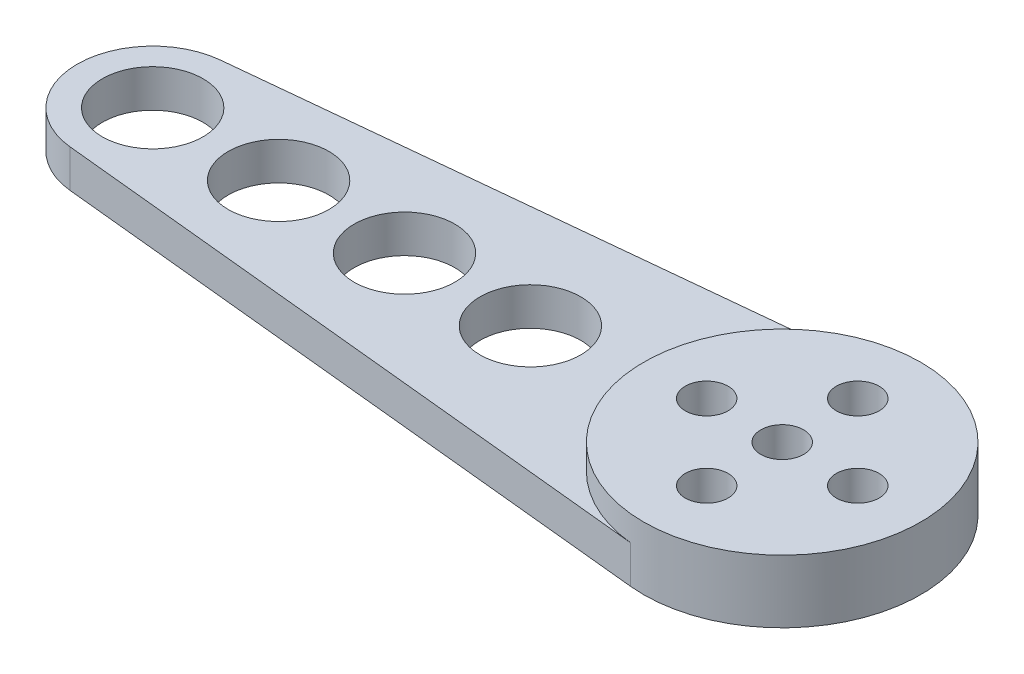
ISO-10303-21;
HEADER;
FILE_DESCRIPTION(('STEP AP214'),'2;1');
FILE_NAME('part.step','',(''),(''),'','','');
FILE_SCHEMA(('AUTOMOTIVE_DESIGN { 1 0 10303 214 1 1 1 1 }'));
ENDSEC;
DATA;
#1=APPLICATION_CONTEXT('core data for automotive mechanical design processes');
#2=APPLICATION_PROTOCOL_DEFINITION('international standard','automotive_design',2000,#1);
#3=PRODUCT_CONTEXT('',#1,'mechanical');
#4=PRODUCT('Part','Part','',(#3));
#5=PRODUCT_RELATED_PRODUCT_CATEGORY('part','',(#4));
#6=PRODUCT_DEFINITION_FORMATION('','',#4);
#7=PRODUCT_DEFINITION_CONTEXT('part definition',#1,'design');
#8=PRODUCT_DEFINITION('design','',#6,#7);
#9=PRODUCT_DEFINITION_SHAPE('','',#8);
#10=(LENGTH_UNIT() NAMED_UNIT(*) SI_UNIT(.MILLI.,.METRE.));
#11=(NAMED_UNIT(*) PLANE_ANGLE_UNIT() SI_UNIT($,.RADIAN.));
#12=(NAMED_UNIT(*) SI_UNIT($,.STERADIAN.) SOLID_ANGLE_UNIT());
#13=UNCERTAINTY_MEASURE_WITH_UNIT(LENGTH_MEASURE(1.E-05),#10,'distance_accuracy_value','');
#14=(GEOMETRIC_REPRESENTATION_CONTEXT(3) GLOBAL_UNCERTAINTY_ASSIGNED_CONTEXT((#13)) GLOBAL_UNIT_ASSIGNED_CONTEXT((#10,
#11,#12)) REPRESENTATION_CONTEXT('',''));
#15=CARTESIAN_POINT('',(0.,0.,0.));
#16=DIRECTION('',(0.,0.,1.));
#17=DIRECTION('',(1.,0.,0.));
#18=AXIS2_PLACEMENT_3D('',#15,#16,#17);
#19=CARTESIAN_POINT('',(-50.,3.,0.));
#20=DIRECTION('',(0.,1.,0.));
#21=DIRECTION('',(0.,0.,1.));
#22=AXIS2_PLACEMENT_3D('',#19,#20,#21);
#23=PLANE('',#22);
#24=CARTESIAN_POINT('',(0.,3.,0.));
#25=DIRECTION('',(0.,1.,0.));
#26=DIRECTION('',(0.,0.,1.));
#27=AXIS2_PLACEMENT_3D('',#24,#25,#26);
#28=CIRCLE('',#27,11.);
#29=CARTESIAN_POINT('',(-1.1,3.,-10.9448618081728));
#30=VERTEX_POINT('',#29);
#31=CARTESIAN_POINT('',(-1.1,3.,10.9448618081728));
#32=VERTEX_POINT('',#31);
#33=EDGE_CURVE('E174',#30,#32,#28,.T.);
#34=ORIENTED_EDGE('',*,*,#33,.F.);
#35=DIRECTION('',(-0.99498743710662,0.,0.1));
#36=VECTOR('',#35,1.);
#37=CARTESIAN_POINT('',(-50.6,3.,-5.96992462263971));
#38=LINE('',#37,#36);
#39=CARTESIAN_POINT('',(-50.6,3.,-5.96992462263971));
#40=VERTEX_POINT('',#39);
#41=EDGE_CURVE('E58',#30,#40,#38,.T.);
#42=ORIENTED_EDGE('',*,*,#41,.T.);
#43=CARTESIAN_POINT('',(-50.,3.,0.));
#44=DIRECTION('',(0.,1.,0.));
#45=DIRECTION('',(0.,0.,1.));
#46=AXIS2_PLACEMENT_3D('',#43,#44,#45);
#47=CIRCLE('',#46,6.);
#48=CARTESIAN_POINT('',(-50.6,3.,5.96992462263973));
#49=VERTEX_POINT('',#48);
#50=EDGE_CURVE('E205',#40,#49,#47,.T.);
#51=ORIENTED_EDGE('',*,*,#50,.T.);
#52=DIRECTION('',(0.99498743710662,0.,0.0999999999999999));
#53=VECTOR('',#52,1.);
#54=CARTESIAN_POINT('',(-50.6,3.,5.96992462263973));
#55=LINE('',#54,#53);
#56=EDGE_CURVE('E84',#49,#32,#55,.T.);
#57=ORIENTED_EDGE('',*,*,#56,.T.);
#58=EDGE_LOOP('',(#34,#42,#51,#57));
#59=FACE_BOUND('',#58,.T.);
#60=CARTESIAN_POINT('',(-30.,3.,0.));
#61=DIRECTION('',(0.,1.,0.));
#62=DIRECTION('',(0.,0.,1.));
#63=AXIS2_PLACEMENT_3D('',#60,#61,#62);
#64=CIRCLE('',#63,4.00000000000001);
#65=CARTESIAN_POINT('',(-30.,3.,4.00000000000001));
#66=VERTEX_POINT('',#65);
#67=EDGE_CURVE('E187',#66,#66,#64,.T.);
#68=ORIENTED_EDGE('',*,*,#67,.F.);
#69=EDGE_LOOP('',(#68));
#70=FACE_BOUND('',#69,.T.);
#71=CARTESIAN_POINT('',(-50.,3.,0.));
#72=DIRECTION('',(0.,1.,0.));
#73=DIRECTION('',(0.,0.,1.));
#74=AXIS2_PLACEMENT_3D('',#71,#72,#73);
#75=CIRCLE('',#74,4.00000000000001);
#76=CARTESIAN_POINT('',(-50.,3.,4.00000000000001));
#77=VERTEX_POINT('',#76);
#78=EDGE_CURVE('E199',#77,#77,#75,.T.);
#79=ORIENTED_EDGE('',*,*,#78,.F.);
#80=EDGE_LOOP('',(#79));
#81=FACE_BOUND('',#80,.T.);
#82=CARTESIAN_POINT('',(-40.,3.,0.));
#83=DIRECTION('',(0.,1.,0.));
#84=DIRECTION('',(0.,0.,1.));
#85=AXIS2_PLACEMENT_3D('',#82,#83,#84);
#86=CIRCLE('',#85,4.00000000000001);
#87=CARTESIAN_POINT('',(-40.,3.,4.00000000000001));
#88=VERTEX_POINT('',#87);
#89=EDGE_CURVE('E193',#88,#88,#86,.T.);
#90=ORIENTED_EDGE('',*,*,#89,.F.);
#91=EDGE_LOOP('',(#90));
#92=FACE_BOUND('',#91,.T.);
#93=CARTESIAN_POINT('',(-20.,3.,0.));
#94=DIRECTION('',(0.,1.,0.));
#95=DIRECTION('',(0.,0.,1.));
#96=AXIS2_PLACEMENT_3D('',#93,#94,#95);
#97=CIRCLE('',#96,4.00000000000001);
#98=CARTESIAN_POINT('',(-20.,3.,4.00000000000001));
#99=VERTEX_POINT('',#98);
#100=EDGE_CURVE('E181',#99,#99,#97,.T.);
#101=ORIENTED_EDGE('',*,*,#100,.F.);
#102=EDGE_LOOP('',(#101));
#103=FACE_BOUND('',#102,.T.);
#104=ADVANCED_FACE('F33',(#59,#70,#81,#92,#103),#23,.T.);
#105=CARTESIAN_POINT('',(-50.,0.,0.));
#106=DIRECTION('',(0.,1.,0.));
#107=DIRECTION('',(0.,0.,1.));
#108=AXIS2_PLACEMENT_3D('',#105,#106,#107);
#109=PLANE('',#108);
#110=DIRECTION('',(-1.,0.,0.));
#111=VECTOR('',#110,1.);
#112=CARTESIAN_POINT('',(-2.75,0.,2.75));
#113=LINE('',#112,#111);
#114=CARTESIAN_POINT('',(2.75,0.,2.75));
#115=VERTEX_POINT('',#114);
#116=CARTESIAN_POINT('',(-2.75,0.,2.75));
#117=VERTEX_POINT('',#116);
#118=EDGE_CURVE('E138',#115,#117,#113,.T.);
#119=ORIENTED_EDGE('',*,*,#118,.F.);
#120=DIRECTION('',(0.,0.,1.));
#121=VECTOR('',#120,1.);
#122=CARTESIAN_POINT('',(2.75,0.,-2.75));
#123=LINE('',#122,#121);
#124=CARTESIAN_POINT('',(2.75,0.,-2.75));
#125=VERTEX_POINT('',#124);
#126=EDGE_CURVE('E49',#125,#115,#123,.T.);
#127=ORIENTED_EDGE('',*,*,#126,.F.);
#128=DIRECTION('',(1.,0.,0.));
#129=VECTOR('',#128,1.);
#130=CARTESIAN_POINT('',(-2.75,0.,-2.75));
#131=LINE('',#130,#129);
#132=CARTESIAN_POINT('',(-2.75,0.,-2.75));
#133=VERTEX_POINT('',#132);
#134=EDGE_CURVE('E129',#133,#125,#131,.T.);
#135=ORIENTED_EDGE('',*,*,#134,.F.);
#136=DIRECTION('',(0.,0.,-1.));
#137=VECTOR('',#136,1.);
#138=CARTESIAN_POINT('',(-2.75,0.,-2.75));
#139=LINE('',#138,#137);
#140=EDGE_CURVE('E132',#117,#133,#139,.T.);
#141=ORIENTED_EDGE('',*,*,#140,.F.);
#142=EDGE_LOOP('',(#119,#127,#135,#141));
#143=FACE_BOUND('',#142,.T.);
#144=CARTESIAN_POINT('',(-5.99999999999983,0.,1.70530256582424E-13));
#145=DIRECTION('',(0.,1.,0.));
#146=DIRECTION('',(0.,0.,1.));
#147=AXIS2_PLACEMENT_3D('',#144,#145,#146);
#148=CIRCLE('',#147,1.70000000000027);
#149=CARTESIAN_POINT('',(-5.99999999999983,0.,1.70000000000044));
#150=VERTEX_POINT('',#149);
#151=EDGE_CURVE('E154',#150,#150,#148,.T.);
#152=ORIENTED_EDGE('',*,*,#151,.T.);
#153=EDGE_LOOP('',(#152));
#154=FACE_BOUND('',#153,.T.);
#155=CARTESIAN_POINT('',(3.39590937005871E-13,0.,6.));
#156=DIRECTION('',(0.,1.,0.));
#157=DIRECTION('',(0.,0.,1.));
#158=AXIS2_PLACEMENT_3D('',#155,#156,#157);
#159=CIRCLE('',#158,1.70000000000036);
#160=CARTESIAN_POINT('',(3.39590937005871E-13,0.,7.70000000000036));
#161=VERTEX_POINT('',#160);
#162=EDGE_CURVE('E147',#161,#161,#159,.T.);
#163=ORIENTED_EDGE('',*,*,#162,.T.);
#164=EDGE_LOOP('',(#163));
#165=FACE_BOUND('',#164,.T.);
#166=CARTESIAN_POINT('',(6.00000000000017,0.,-1.69795468502936E-13));
#167=DIRECTION('',(0.,1.,0.));
#168=DIRECTION('',(0.,0.,1.));
#169=AXIS2_PLACEMENT_3D('',#166,#167,#168);
#170=CIRCLE('',#169,1.70000000000013);
#171=CARTESIAN_POINT('',(6.00000000000017,0.,1.69999999999996));
#172=VERTEX_POINT('',#171);
#173=EDGE_CURVE('E167',#172,#172,#170,.T.);
#174=ORIENTED_EDGE('',*,*,#173,.T.);
#175=EDGE_LOOP('',(#174));
#176=FACE_BOUND('',#175,.T.);
#177=CARTESIAN_POINT('',(0.,0.,-6.));
#178=DIRECTION('',(0.,1.,0.));
#179=DIRECTION('',(0.,0.,1.));
#180=AXIS2_PLACEMENT_3D('',#177,#178,#179);
#181=CIRCLE('',#180,1.7);
#182=CARTESIAN_POINT('',(0.,0.,-4.3));
#183=VERTEX_POINT('',#182);
#184=EDGE_CURVE('E160',#183,#183,#181,.T.);
#185=ORIENTED_EDGE('',*,*,#184,.T.);
#186=EDGE_LOOP('',(#185));
#187=FACE_BOUND('',#186,.T.);
#188=CARTESIAN_POINT('',(-50.,0.,0.));
#189=DIRECTION('',(0.,1.,0.));
#190=DIRECTION('',(0.,0.,1.));
#191=AXIS2_PLACEMENT_3D('',#188,#189,#190);
#192=CIRCLE('',#191,6.);
#193=CARTESIAN_POINT('',(-50.6,0.,-5.96992462263971));
#194=VERTEX_POINT('',#193);
#195=CARTESIAN_POINT('',(-50.6,0.,5.96992462263973));
#196=VERTEX_POINT('',#195);
#197=EDGE_CURVE('E202',#194,#196,#192,.T.);
#198=ORIENTED_EDGE('',*,*,#197,.F.);
#199=DIRECTION('',(-0.99498743710662,0.,0.1));
#200=VECTOR('',#199,1.);
#201=CARTESIAN_POINT('',(-50.6,0.,-5.96992462263971));
#202=LINE('',#201,#200);
#203=CARTESIAN_POINT('',(-1.1,0.,-10.9448618081728));
#204=VERTEX_POINT('',#203);
#205=EDGE_CURVE('E79',#204,#194,#202,.T.);
#206=ORIENTED_EDGE('',*,*,#205,.F.);
#207=CARTESIAN_POINT('',(0.,0.,0.));
#208=DIRECTION('',(0.,1.,0.));
#209=DIRECTION('',(0.,0.,1.));
#210=AXIS2_PLACEMENT_3D('',#207,#208,#209);
#211=CIRCLE('',#210,11.);
#212=CARTESIAN_POINT('',(-1.1,0.,10.9448618081728));
#213=VERTEX_POINT('',#212);
#214=EDGE_CURVE('E214',#213,#204,#211,.T.);
#215=ORIENTED_EDGE('',*,*,#214,.F.);
#216=DIRECTION('',(0.99498743710662,0.,0.0999999999999999));
#217=VECTOR('',#216,1.);
#218=CARTESIAN_POINT('',(-50.6,0.,5.96992462263973));
#219=LINE('',#218,#217);
#220=EDGE_CURVE('E212',#196,#213,#219,.T.);
#221=ORIENTED_EDGE('',*,*,#220,.F.);
#222=EDGE_LOOP('',(#198,#206,#215,#221));
#223=FACE_BOUND('',#222,.T.);
#224=CARTESIAN_POINT('',(-50.,0.,0.));
#225=DIRECTION('',(0.,1.,0.));
#226=DIRECTION('',(0.,0.,1.));
#227=AXIS2_PLACEMENT_3D('',#224,#225,#226);
#228=CIRCLE('',#227,4.00000000000001);
#229=CARTESIAN_POINT('',(-50.,0.,4.00000000000001));
#230=VERTEX_POINT('',#229);
#231=EDGE_CURVE('E196',#230,#230,#228,.T.);
#232=ORIENTED_EDGE('',*,*,#231,.T.);
#233=EDGE_LOOP('',(#232));
#234=FACE_BOUND('',#233,.T.);
#235=CARTESIAN_POINT('',(-40.,0.,0.));
#236=DIRECTION('',(0.,1.,0.));
#237=DIRECTION('',(0.,0.,1.));
#238=AXIS2_PLACEMENT_3D('',#235,#236,#237);
#239=CIRCLE('',#238,4.00000000000001);
#240=CARTESIAN_POINT('',(-40.,0.,4.00000000000001));
#241=VERTEX_POINT('',#240);
#242=EDGE_CURVE('E190',#241,#241,#239,.T.);
#243=ORIENTED_EDGE('',*,*,#242,.T.);
#244=EDGE_LOOP('',(#243));
#245=FACE_BOUND('',#244,.T.);
#246=CARTESIAN_POINT('',(-30.,0.,0.));
#247=DIRECTION('',(0.,1.,0.));
#248=DIRECTION('',(0.,0.,1.));
#249=AXIS2_PLACEMENT_3D('',#246,#247,#248);
#250=CIRCLE('',#249,4.00000000000001);
#251=CARTESIAN_POINT('',(-30.,0.,4.00000000000001));
#252=VERTEX_POINT('',#251);
#253=EDGE_CURVE('E184',#252,#252,#250,.T.);
#254=ORIENTED_EDGE('',*,*,#253,.T.);
#255=EDGE_LOOP('',(#254));
#256=FACE_BOUND('',#255,.T.);
#257=CARTESIAN_POINT('',(-20.,0.,0.));
#258=DIRECTION('',(0.,1.,0.));
#259=DIRECTION('',(0.,0.,1.));
#260=AXIS2_PLACEMENT_3D('',#257,#258,#259);
#261=CIRCLE('',#260,4.00000000000001);
#262=CARTESIAN_POINT('',(-20.,0.,4.00000000000001));
#263=VERTEX_POINT('',#262);
#264=EDGE_CURVE('E178',#263,#263,#261,.T.);
#265=ORIENTED_EDGE('',*,*,#264,.T.);
#266=EDGE_LOOP('',(#265));
#267=FACE_BOUND('',#266,.T.);
#268=ADVANCED_FACE('F228',(#143,#154,#165,#176,#187,#223,#234,#245,#256,#267),#109,.F.);
#269=CARTESIAN_POINT('',(-50.,3.,0.));
#270=DIRECTION('',(0.,-1.,0.));
#271=DIRECTION('',(0.,0.,-1.));
#272=AXIS2_PLACEMENT_3D('',#269,#270,#271);
#273=CYLINDRICAL_SURFACE('',#272,6.);
#274=ORIENTED_EDGE('',*,*,#197,.T.);
#275=DIRECTION('',(0.,-1.,0.));
#276=VECTOR('',#275,1.);
#277=CARTESIAN_POINT('',(-50.6,3.,5.96992462263973));
#278=LINE('',#277,#276);
#279=EDGE_CURVE('E11',#49,#196,#278,.T.);
#280=ORIENTED_EDGE('',*,*,#279,.F.);
#281=ORIENTED_EDGE('',*,*,#50,.F.);
#282=DIRECTION('',(0.,-1.,0.));
#283=VECTOR('',#282,1.);
#284=CARTESIAN_POINT('',(-50.6,3.,-5.96992462263971));
#285=LINE('',#284,#283);
#286=EDGE_CURVE('E209',#40,#194,#285,.T.);
#287=ORIENTED_EDGE('',*,*,#286,.T.);
#288=EDGE_LOOP('',(#274,#280,#281,#287));
#289=FACE_BOUND('',#288,.T.);
#290=ADVANCED_FACE('F35',(#289),#273,.T.);
#291=CARTESIAN_POINT('',(-50.6,3.,5.96992462263973));
#292=DIRECTION('',(0.0999999999999998,0.,-0.99498743710662));
#293=DIRECTION('',(-0.99498743710662,0.,-0.0999999999999998));
#294=AXIS2_PLACEMENT_3D('',#291,#292,#293);
#295=PLANE('',#294);
#296=ORIENTED_EDGE('',*,*,#220,.T.);
#297=DIRECTION('',(0.,-1.,0.));
#298=VECTOR('',#297,1.);
#299=CARTESIAN_POINT('',(-1.1,3.,10.9448618081728));
#300=LINE('',#299,#298);
#301=EDGE_CURVE('E42',#32,#213,#300,.T.);
#302=ORIENTED_EDGE('',*,*,#301,.F.);
#303=ORIENTED_EDGE('',*,*,#56,.F.);
#304=ORIENTED_EDGE('',*,*,#279,.T.);
#305=EDGE_LOOP('',(#296,#302,#303,#304));
#306=FACE_BOUND('',#305,.T.);
#307=ADVANCED_FACE('F259',(#306),#295,.F.);
#308=CARTESIAN_POINT('',(0.,3.,0.));
#309=DIRECTION('',(0.,-1.,0.));
#310=DIRECTION('',(0.,0.,-1.));
#311=AXIS2_PLACEMENT_3D('',#308,#309,#310);
#312=CYLINDRICAL_SURFACE('',#311,11.);
#313=ORIENTED_EDGE('',*,*,#214,.T.);
#314=DIRECTION('',(0.,-1.,0.));
#315=VECTOR('',#314,1.);
#316=CARTESIAN_POINT('',(-1.1,3.,-10.9448618081728));
#317=LINE('',#316,#315);
#318=EDGE_CURVE('E218',#30,#204,#317,.T.);
#319=ORIENTED_EDGE('',*,*,#318,.F.);
#320=ORIENTED_EDGE('',*,*,#33,.T.);
#321=ORIENTED_EDGE('',*,*,#301,.T.);
#322=EDGE_LOOP('',(#313,#319,#320,#321));
#323=FACE_BOUND('',#322,.T.);
#324=CARTESIAN_POINT('',(0.,5.,0.));
#325=DIRECTION('',(0.,1.,0.));
#326=DIRECTION('',(0.,0.,1.));
#327=AXIS2_PLACEMENT_3D('',#324,#325,#326);
#328=CIRCLE('',#327,11.);
#329=CARTESIAN_POINT('',(0.,5.,11.));
#330=VERTEX_POINT('',#329);
#331=EDGE_CURVE('E175',#330,#330,#328,.T.);
#332=ORIENTED_EDGE('',*,*,#331,.F.);
#333=EDGE_LOOP('',(#332));
#334=FACE_BOUND('',#333,.T.);
#335=ADVANCED_FACE('F223',(#323,#334),#312,.T.);
#336=CARTESIAN_POINT('',(-50.6,3.,-5.96992462263971));
#337=DIRECTION('',(0.1,0.,0.99498743710662));
#338=DIRECTION('',(0.99498743710662,0.,-0.1));
#339=AXIS2_PLACEMENT_3D('',#336,#337,#338);
#340=PLANE('',#339);
#341=ORIENTED_EDGE('',*,*,#205,.T.);
#342=ORIENTED_EDGE('',*,*,#286,.F.);
#343=ORIENTED_EDGE('',*,*,#41,.F.);
#344=ORIENTED_EDGE('',*,*,#318,.T.);
#345=EDGE_LOOP('',(#341,#342,#343,#344));
#346=FACE_BOUND('',#345,.T.);
#347=ADVANCED_FACE('F233',(#346),#340,.F.);
#348=CARTESIAN_POINT('',(-50.,3.,0.));
#349=DIRECTION('',(0.,-1.,0.));
#350=DIRECTION('',(0.,0.,-1.));
#351=AXIS2_PLACEMENT_3D('',#348,#349,#350);
#352=CYLINDRICAL_SURFACE('',#351,4.00000000000001);
#353=ORIENTED_EDGE('',*,*,#78,.T.);
#354=EDGE_LOOP('',(#353));
#355=FACE_BOUND('',#354,.T.);
#356=ORIENTED_EDGE('',*,*,#231,.F.);
#357=EDGE_LOOP('',(#356));
#358=FACE_BOUND('',#357,.T.);
#359=ADVANCED_FACE('F265',(#355,#358),#352,.F.);
#360=CARTESIAN_POINT('',(-40.,3.,0.));
#361=DIRECTION('',(0.,-1.,0.));
#362=DIRECTION('',(0.,0.,-1.));
#363=AXIS2_PLACEMENT_3D('',#360,#361,#362);
#364=CYLINDRICAL_SURFACE('',#363,4.00000000000001);
#365=ORIENTED_EDGE('',*,*,#89,.T.);
#366=EDGE_LOOP('',(#365));
#367=FACE_BOUND('',#366,.T.);
#368=ORIENTED_EDGE('',*,*,#242,.F.);
#369=EDGE_LOOP('',(#368));
#370=FACE_BOUND('',#369,.T.);
#371=ADVANCED_FACE('F288',(#367,#370),#364,.F.);
#372=CARTESIAN_POINT('',(-30.,3.,0.));
#373=DIRECTION('',(0.,-1.,0.));
#374=DIRECTION('',(0.,0.,-1.));
#375=AXIS2_PLACEMENT_3D('',#372,#373,#374);
#376=CYLINDRICAL_SURFACE('',#375,4.00000000000001);
#377=ORIENTED_EDGE('',*,*,#67,.T.);
#378=EDGE_LOOP('',(#377));
#379=FACE_BOUND('',#378,.T.);
#380=ORIENTED_EDGE('',*,*,#253,.F.);
#381=EDGE_LOOP('',(#380));
#382=FACE_BOUND('',#381,.T.);
#383=ADVANCED_FACE('F249',(#379,#382),#376,.F.);
#384=CARTESIAN_POINT('',(-20.,3.,0.));
#385=DIRECTION('',(0.,-1.,0.));
#386=DIRECTION('',(0.,0.,-1.));
#387=AXIS2_PLACEMENT_3D('',#384,#385,#386);
#388=CYLINDRICAL_SURFACE('',#387,4.00000000000001);
#389=ORIENTED_EDGE('',*,*,#100,.T.);
#390=EDGE_LOOP('',(#389));
#391=FACE_BOUND('',#390,.T.);
#392=ORIENTED_EDGE('',*,*,#264,.F.);
#393=EDGE_LOOP('',(#392));
#394=FACE_BOUND('',#393,.T.);
#395=ADVANCED_FACE('F245',(#391,#394),#388,.F.);
#396=CARTESIAN_POINT('',(0.,5.,0.));
#397=DIRECTION('',(0.,1.,0.));
#398=DIRECTION('',(0.,0.,1.));
#399=AXIS2_PLACEMENT_3D('',#396,#397,#398);
#400=PLANE('',#399);
#401=CARTESIAN_POINT('',(-5.99999999999983,5.,1.70530256582424E-13));
#402=DIRECTION('',(0.,1.,0.));
#403=DIRECTION('',(0.,0.,1.));
#404=AXIS2_PLACEMENT_3D('',#401,#402,#403);
#405=CIRCLE('',#404,1.70000000000027);
#406=CARTESIAN_POINT('',(-5.99999999999983,5.,1.70000000000044));
#407=VERTEX_POINT('',#406);
#408=EDGE_CURVE('E157',#407,#407,#405,.T.);
#409=ORIENTED_EDGE('',*,*,#408,.F.);
#410=EDGE_LOOP('',(#409));
#411=FACE_BOUND('',#410,.T.);
#412=CARTESIAN_POINT('',(3.39590937005871E-13,5.,6.));
#413=DIRECTION('',(0.,1.,0.));
#414=DIRECTION('',(0.,0.,1.));
#415=AXIS2_PLACEMENT_3D('',#412,#413,#414);
#416=CIRCLE('',#415,1.70000000000036);
#417=CARTESIAN_POINT('',(3.39590937005871E-13,5.,7.70000000000036));
#418=VERTEX_POINT('',#417);
#419=EDGE_CURVE('E151',#418,#418,#416,.T.);
#420=ORIENTED_EDGE('',*,*,#419,.F.);
#421=EDGE_LOOP('',(#420));
#422=FACE_BOUND('',#421,.T.);
#423=CARTESIAN_POINT('',(6.00000000000017,5.,-1.69795468502936E-13));
#424=DIRECTION('',(0.,1.,0.));
#425=DIRECTION('',(0.,0.,1.));
#426=AXIS2_PLACEMENT_3D('',#423,#424,#425);
#427=CIRCLE('',#426,1.70000000000013);
#428=CARTESIAN_POINT('',(6.00000000000017,5.,1.69999999999996));
#429=VERTEX_POINT('',#428);
#430=EDGE_CURVE('E150',#429,#429,#427,.T.);
#431=ORIENTED_EDGE('',*,*,#430,.F.);
#432=EDGE_LOOP('',(#431));
#433=FACE_BOUND('',#432,.T.);
#434=CARTESIAN_POINT('',(0.,5.,-6.));
#435=DIRECTION('',(0.,1.,0.));
#436=DIRECTION('',(0.,0.,1.));
#437=AXIS2_PLACEMENT_3D('',#434,#435,#436);
#438=CIRCLE('',#437,1.7);
#439=CARTESIAN_POINT('',(0.,5.,-4.3));
#440=VERTEX_POINT('',#439);
#441=EDGE_CURVE('E164',#440,#440,#438,.T.);
#442=ORIENTED_EDGE('',*,*,#441,.F.);
#443=EDGE_LOOP('',(#442));
#444=FACE_BOUND('',#443,.T.);
#445=CARTESIAN_POINT('',(0.,5.,0.));
#446=DIRECTION('',(0.,1.,0.));
#447=DIRECTION('',(0.,0.,1.));
#448=AXIS2_PLACEMENT_3D('',#445,#446,#447);
#449=CIRCLE('',#448,1.7);
#450=CARTESIAN_POINT('',(0.,5.,1.7));
#451=VERTEX_POINT('',#450);
#452=EDGE_CURVE('E163',#451,#451,#449,.T.);
#453=ORIENTED_EDGE('',*,*,#452,.F.);
#454=EDGE_LOOP('',(#453));
#455=FACE_BOUND('',#454,.T.);
#456=ORIENTED_EDGE('',*,*,#331,.T.);
#457=EDGE_LOOP('',(#456));
#458=FACE_BOUND('',#457,.T.);
#459=ADVANCED_FACE('F248',(#411,#422,#433,#444,#455,#458),#400,.T.);
#460=CARTESIAN_POINT('',(0.,0.,0.));
#461=DIRECTION('',(0.,1.,0.));
#462=DIRECTION('',(0.,0.,1.));
#463=AXIS2_PLACEMENT_3D('',#460,#461,#462);
#464=CYLINDRICAL_SURFACE('',#463,1.7);
#465=CARTESIAN_POINT('',(0.,1.5,0.));
#466=DIRECTION('',(0.,1.,0.));
#467=DIRECTION('',(0.,0.,1.));
#468=AXIS2_PLACEMENT_3D('',#465,#466,#467);
#469=CIRCLE('',#468,1.7);
#470=CARTESIAN_POINT('',(0.,1.5,1.7));
#471=VERTEX_POINT('',#470);
#472=EDGE_CURVE('E37',#471,#471,#469,.F.);
#473=ORIENTED_EDGE('',*,*,#472,.T.);
#474=EDGE_LOOP('',(#473));
#475=FACE_BOUND('',#474,.T.);
#476=ORIENTED_EDGE('',*,*,#452,.T.);
#477=EDGE_LOOP('',(#476));
#478=FACE_BOUND('',#477,.T.);
#479=ADVANCED_FACE('F312',(#475,#478),#464,.F.);
#480=CARTESIAN_POINT('',(0.,0.,-6.));
#481=DIRECTION('',(0.,1.,0.));
#482=DIRECTION('',(0.,0.,1.));
#483=AXIS2_PLACEMENT_3D('',#480,#481,#482);
#484=CYLINDRICAL_SURFACE('',#483,1.7);
#485=ORIENTED_EDGE('',*,*,#184,.F.);
#486=EDGE_LOOP('',(#485));
#487=FACE_BOUND('',#486,.T.);
#488=ORIENTED_EDGE('',*,*,#441,.T.);
#489=EDGE_LOOP('',(#488));
#490=FACE_BOUND('',#489,.T.);
#491=ADVANCED_FACE('F321',(#487,#490),#484,.F.);
#492=CARTESIAN_POINT('',(6.00000000000017,0.,-1.69795468502936E-13));
#493=DIRECTION('',(0.,1.,0.));
#494=DIRECTION('',(0.,0.,1.));
#495=AXIS2_PLACEMENT_3D('',#492,#493,#494);
#496=CYLINDRICAL_SURFACE('',#495,1.70000000000013);
#497=ORIENTED_EDGE('',*,*,#173,.F.);
#498=EDGE_LOOP('',(#497));
#499=FACE_BOUND('',#498,.T.);
#500=ORIENTED_EDGE('',*,*,#430,.T.);
#501=EDGE_LOOP('',(#500));
#502=FACE_BOUND('',#501,.T.);
#503=ADVANCED_FACE('F329',(#499,#502),#496,.F.);
#504=CARTESIAN_POINT('',(3.39590937005871E-13,0.,6.));
#505=DIRECTION('',(0.,1.,0.));
#506=DIRECTION('',(0.,0.,1.));
#507=AXIS2_PLACEMENT_3D('',#504,#505,#506);
#508=CYLINDRICAL_SURFACE('',#507,1.70000000000036);
#509=ORIENTED_EDGE('',*,*,#162,.F.);
#510=EDGE_LOOP('',(#509));
#511=FACE_BOUND('',#510,.T.);
#512=ORIENTED_EDGE('',*,*,#419,.T.);
#513=EDGE_LOOP('',(#512));
#514=FACE_BOUND('',#513,.T.);
#515=ADVANCED_FACE('F337',(#511,#514),#508,.F.);
#516=CARTESIAN_POINT('',(-5.99999999999983,0.,1.70530256582424E-13));
#517=DIRECTION('',(0.,1.,0.));
#518=DIRECTION('',(0.,0.,1.));
#519=AXIS2_PLACEMENT_3D('',#516,#517,#518);
#520=CYLINDRICAL_SURFACE('',#519,1.70000000000027);
#521=ORIENTED_EDGE('',*,*,#151,.F.);
#522=EDGE_LOOP('',(#521));
#523=FACE_BOUND('',#522,.T.);
#524=ORIENTED_EDGE('',*,*,#408,.T.);
#525=EDGE_LOOP('',(#524));
#526=FACE_BOUND('',#525,.T.);
#527=ADVANCED_FACE('F345',(#523,#526),#520,.F.);
#528=CARTESIAN_POINT('',(0.,1.5,0.));
#529=DIRECTION('',(0.,1.,0.));
#530=DIRECTION('',(0.,0.,1.));
#531=AXIS2_PLACEMENT_3D('',#528,#529,#530);
#532=PLANE('',#531);
#533=DIRECTION('',(0.,0.,1.));
#534=VECTOR('',#533,1.);
#535=CARTESIAN_POINT('',(2.75,1.5,-2.75));
#536=LINE('',#535,#534);
#537=CARTESIAN_POINT('',(2.75,1.5,-2.75));
#538=VERTEX_POINT('',#537);
#539=CARTESIAN_POINT('',(2.75,1.5,2.75));
#540=VERTEX_POINT('',#539);
#541=EDGE_CURVE('E110',#538,#540,#536,.T.);
#542=ORIENTED_EDGE('',*,*,#541,.T.);
#543=DIRECTION('',(-1.,0.,0.));
#544=VECTOR('',#543,1.);
#545=CARTESIAN_POINT('',(-2.75,1.5,2.75));
#546=LINE('',#545,#544);
#547=CARTESIAN_POINT('',(-2.75,1.5,2.75));
#548=VERTEX_POINT('',#547);
#549=EDGE_CURVE('E119',#540,#548,#546,.T.);
#550=ORIENTED_EDGE('',*,*,#549,.T.);
#551=DIRECTION('',(0.,0.,-1.));
#552=VECTOR('',#551,1.);
#553=CARTESIAN_POINT('',(-2.75,1.5,-2.75));
#554=LINE('',#553,#552);
#555=CARTESIAN_POINT('',(-2.75,1.5,-2.75));
#556=VERTEX_POINT('',#555);
#557=EDGE_CURVE('E124',#548,#556,#554,.T.);
#558=ORIENTED_EDGE('',*,*,#557,.T.);
#559=DIRECTION('',(1.,0.,0.));
#560=VECTOR('',#559,1.);
#561=CARTESIAN_POINT('',(-2.75,1.5,-2.75));
#562=LINE('',#561,#560);
#563=EDGE_CURVE('E116',#556,#538,#562,.T.);
#564=ORIENTED_EDGE('',*,*,#563,.T.);
#565=EDGE_LOOP('',(#542,#550,#558,#564));
#566=FACE_BOUND('',#565,.T.);
#567=ORIENTED_EDGE('',*,*,#472,.F.);
#568=EDGE_LOOP('',(#567));
#569=FACE_BOUND('',#568,.T.);
#570=ADVANCED_FACE('F126',(#566,#569),#532,.F.);
#571=CARTESIAN_POINT('',(2.75,1.5,-2.75));
#572=DIRECTION('',(1.,0.,0.));
#573=DIRECTION('',(0.,0.,-1.));
#574=AXIS2_PLACEMENT_3D('',#571,#572,#573);
#575=PLANE('',#574);
#576=ORIENTED_EDGE('',*,*,#126,.T.);
#577=DIRECTION('',(0.,-1.,0.));
#578=VECTOR('',#577,1.);
#579=CARTESIAN_POINT('',(2.75,1.5,2.75));
#580=LINE('',#579,#578);
#581=EDGE_CURVE('E106',#540,#115,#580,.T.);
#582=ORIENTED_EDGE('',*,*,#581,.F.);
#583=ORIENTED_EDGE('',*,*,#541,.F.);
#584=DIRECTION('',(0.,-1.,0.));
#585=VECTOR('',#584,1.);
#586=CARTESIAN_POINT('',(2.75,1.5,-2.75));
#587=LINE('',#586,#585);
#588=EDGE_CURVE('E142',#538,#125,#587,.T.);
#589=ORIENTED_EDGE('',*,*,#588,.T.);
#590=EDGE_LOOP('',(#576,#582,#583,#589));
#591=FACE_BOUND('',#590,.T.);
#592=ADVANCED_FACE('F108',(#591),#575,.F.);
#593=CARTESIAN_POINT('',(-2.75,1.5,-2.75));
#594=DIRECTION('',(0.,0.,-1.));
#595=DIRECTION('',(-1.,0.,0.));
#596=AXIS2_PLACEMENT_3D('',#593,#594,#595);
#597=PLANE('',#596);
#598=ORIENTED_EDGE('',*,*,#134,.T.);
#599=ORIENTED_EDGE('',*,*,#588,.F.);
#600=ORIENTED_EDGE('',*,*,#563,.F.);
#601=DIRECTION('',(0.,-1.,0.));
#602=VECTOR('',#601,1.);
#603=CARTESIAN_POINT('',(-2.75,1.5,-2.75));
#604=LINE('',#603,#602);
#605=EDGE_CURVE('E144',#556,#133,#604,.T.);
#606=ORIENTED_EDGE('',*,*,#605,.T.);
#607=EDGE_LOOP('',(#598,#599,#600,#606));
#608=FACE_BOUND('',#607,.T.);
#609=ADVANCED_FACE('F365',(#608),#597,.F.);
#610=CARTESIAN_POINT('',(-2.75,1.5,-2.75));
#611=DIRECTION('',(-1.,0.,0.));
#612=DIRECTION('',(0.,0.,1.));
#613=AXIS2_PLACEMENT_3D('',#610,#611,#612);
#614=PLANE('',#613);
#615=ORIENTED_EDGE('',*,*,#140,.T.);
#616=ORIENTED_EDGE('',*,*,#605,.F.);
#617=ORIENTED_EDGE('',*,*,#557,.F.);
#618=DIRECTION('',(0.,-1.,0.));
#619=VECTOR('',#618,1.);
#620=CARTESIAN_POINT('',(-2.75,1.5,2.75));
#621=LINE('',#620,#619);
#622=EDGE_CURVE('E115',#548,#117,#621,.T.);
#623=ORIENTED_EDGE('',*,*,#622,.T.);
#624=EDGE_LOOP('',(#615,#616,#617,#623));
#625=FACE_BOUND('',#624,.T.);
#626=ADVANCED_FACE('F372',(#625),#614,.F.);
#627=CARTESIAN_POINT('',(-2.75,1.5,2.75));
#628=DIRECTION('',(0.,0.,1.));
#629=DIRECTION('',(1.,0.,0.));
#630=AXIS2_PLACEMENT_3D('',#627,#628,#629);
#631=PLANE('',#630);
#632=ORIENTED_EDGE('',*,*,#118,.T.);
#633=ORIENTED_EDGE('',*,*,#622,.F.);
#634=ORIENTED_EDGE('',*,*,#549,.F.);
#635=ORIENTED_EDGE('',*,*,#581,.T.);
#636=EDGE_LOOP('',(#632,#633,#634,#635));
#637=FACE_BOUND('',#636,.T.);
#638=ADVANCED_FACE('F120',(#637),#631,.F.);
#639=CLOSED_SHELL('',(#104,#268,#290,#307,#335,#347,#359,#371,#383,#395,#459,#479,#491,#503,
#515,#527,#570,#592,#609,#626,#638));
#640=MANIFOLD_SOLID_BREP('B2',#639);
#641=ADVANCED_BREP_SHAPE_REPRESENTATION('',(#18,#640),#14);
#642=SHAPE_DEFINITION_REPRESENTATION(#9,#641);
ENDSEC;
END-ISO-10303-21;
